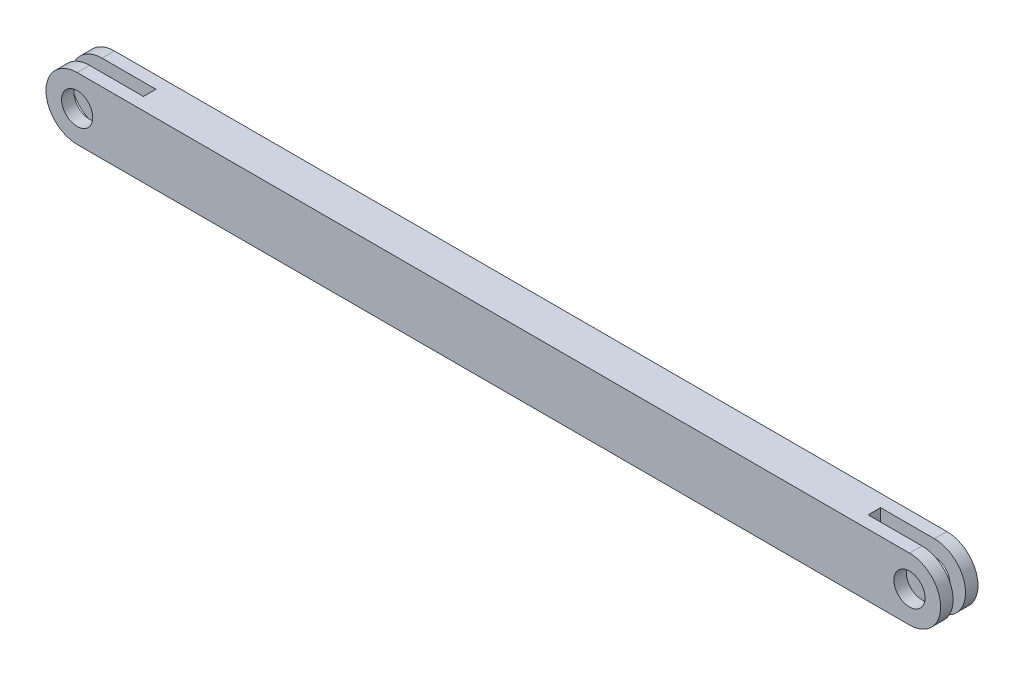
ISO-10303-21;
HEADER;
FILE_DESCRIPTION(('STEP AP214'),'2;1');
FILE_NAME('part.step','',(''),(''),'','','');
FILE_SCHEMA(('AUTOMOTIVE_DESIGN { 1 0 10303 214 1 1 1 1 }'));
ENDSEC;
DATA;
#1=APPLICATION_CONTEXT('core data for automotive mechanical design processes');
#2=APPLICATION_PROTOCOL_DEFINITION('international standard','automotive_design',2000,#1);
#3=PRODUCT_CONTEXT('',#1,'mechanical');
#4=PRODUCT('Part','Part','',(#3));
#5=PRODUCT_RELATED_PRODUCT_CATEGORY('part','',(#4));
#6=PRODUCT_DEFINITION_FORMATION('','',#4);
#7=PRODUCT_DEFINITION_CONTEXT('part definition',#1,'design');
#8=PRODUCT_DEFINITION('design','',#6,#7);
#9=PRODUCT_DEFINITION_SHAPE('','',#8);
#10=(LENGTH_UNIT() NAMED_UNIT(*) SI_UNIT(.MILLI.,.METRE.));
#11=(NAMED_UNIT(*) PLANE_ANGLE_UNIT() SI_UNIT($,.RADIAN.));
#12=(NAMED_UNIT(*) SI_UNIT($,.STERADIAN.) SOLID_ANGLE_UNIT());
#13=UNCERTAINTY_MEASURE_WITH_UNIT(LENGTH_MEASURE(1.E-05),#10,'distance_accuracy_value','');
#14=(GEOMETRIC_REPRESENTATION_CONTEXT(3) GLOBAL_UNCERTAINTY_ASSIGNED_CONTEXT((#13)) GLOBAL_UNIT_ASSIGNED_CONTEXT((#10,
#11,#12)) REPRESENTATION_CONTEXT('',''));
#15=CARTESIAN_POINT('',(0.,0.,0.));
#16=DIRECTION('',(0.,0.,1.));
#17=DIRECTION('',(1.,0.,0.));
#18=AXIS2_PLACEMENT_3D('',#15,#16,#17);
#19=CARTESIAN_POINT('',(-58.1781458426693,-5.35076509103583,3.));
#20=DIRECTION('',(-1.,0.,0.));
#21=DIRECTION('',(0.,0.,1.));
#22=AXIS2_PLACEMENT_3D('',#19,#20,#21);
#23=PLANE('',#22);
#24=DIRECTION('',(0.,0.,-1.));
#25=VECTOR('',#24,1.);
#26=CARTESIAN_POINT('',(-58.1781458426693,4.64923490896418,3.));
#27=LINE('',#26,#25);
#28=CARTESIAN_POINT('',(-58.1781458426693,4.64923490896418,1.));
#29=VERTEX_POINT('',#28);
#30=CARTESIAN_POINT('',(-58.1781458426693,4.64923490896419,-1.));
#31=VERTEX_POINT('',#30);
#32=EDGE_CURVE('E47',#29,#31,#27,.T.);
#33=ORIENTED_EDGE('',*,*,#32,.T.);
#34=DIRECTION('',(0.,-1.,0.));
#35=VECTOR('',#34,1.);
#36=CARTESIAN_POINT('',(-58.1781458426693,-5.35076509103583,-1.));
#37=LINE('',#36,#35);
#38=CARTESIAN_POINT('',(-58.1781458426693,-5.35076509103581,-1.));
#39=VERTEX_POINT('',#38);
#40=EDGE_CURVE('E135',#31,#39,#37,.T.);
#41=ORIENTED_EDGE('',*,*,#40,.T.);
#42=DIRECTION('',(0.,0.,-1.));
#43=VECTOR('',#42,1.);
#44=CARTESIAN_POINT('',(-58.1781458426693,-5.35076509103583,3.));
#45=LINE('',#44,#43);
#46=CARTESIAN_POINT('',(-58.1781458426693,-5.35076509103583,1.));
#47=VERTEX_POINT('',#46);
#48=EDGE_CURVE('E59',#47,#39,#45,.T.);
#49=ORIENTED_EDGE('',*,*,#48,.F.);
#50=DIRECTION('',(0.,1.,0.));
#51=VECTOR('',#50,1.);
#52=CARTESIAN_POINT('',(-58.1781458426693,-5.35076509103583,1.));
#53=LINE('',#52,#51);
#54=EDGE_CURVE('E54',#47,#29,#53,.T.);
#55=ORIENTED_EDGE('',*,*,#54,.T.);
#56=EDGE_LOOP('',(#33,#41,#49,#55));
#57=FACE_BOUND('',#56,.T.);
#58=ADVANCED_FACE('F39',(#57),#23,.T.);
#59=CARTESIAN_POINT('',(0.,0.,1.));
#60=DIRECTION('',(0.,0.,1.));
#61=DIRECTION('',(1.,0.,0.));
#62=AXIS2_PLACEMENT_3D('',#59,#60,#61);
#63=PLANE('',#62);
#64=CARTESIAN_POINT('',(66.8218541573307,-0.350765091035815,1.));
#65=DIRECTION('',(0.,0.,1.));
#66=DIRECTION('',(1.,0.,0.));
#67=AXIS2_PLACEMENT_3D('',#64,#65,#66);
#68=CIRCLE('',#67,2.49999999999999);
#69=CARTESIAN_POINT('',(69.3218541573307,-0.350765091035815,1.));
#70=VERTEX_POINT('',#69);
#71=EDGE_CURVE('E214',#70,#70,#68,.T.);
#72=ORIENTED_EDGE('',*,*,#71,.T.);
#73=EDGE_LOOP('',(#72));
#74=FACE_BOUND('',#73,.T.);
#75=DIRECTION('',(0.,-1.,0.));
#76=VECTOR('',#75,1.);
#77=CARTESIAN_POINT('',(58.1781458426693,0.,1.));
#78=LINE('',#77,#76);
#79=CARTESIAN_POINT('',(58.1781458426693,4.64923490896418,1.));
#80=VERTEX_POINT('',#79);
#81=CARTESIAN_POINT('',(58.1781458426693,-5.35076509103583,1.));
#82=VERTEX_POINT('',#81);
#83=EDGE_CURVE('E190',#80,#82,#78,.T.);
#84=ORIENTED_EDGE('',*,*,#83,.F.);
#85=DIRECTION('',(1.,0.,0.));
#86=VECTOR('',#85,1.);
#87=CARTESIAN_POINT('',(0.,4.64923490896419,1.));
#88=LINE('',#87,#86);
#89=CARTESIAN_POINT('',(66.8218541573307,4.64923490896419,1.));
#90=VERTEX_POINT('',#89);
#91=EDGE_CURVE('E221',#80,#90,#88,.T.);
#92=ORIENTED_EDGE('',*,*,#91,.T.);
#93=CARTESIAN_POINT('',(66.8218541573307,-0.350765091035815,1.));
#94=DIRECTION('',(0.,0.,1.));
#95=DIRECTION('',(1.,0.,0.));
#96=AXIS2_PLACEMENT_3D('',#93,#94,#95);
#97=CIRCLE('',#96,5.);
#98=CARTESIAN_POINT('',(66.8218541573307,-5.35076509103581,1.));
#99=VERTEX_POINT('',#98);
#100=EDGE_CURVE('E217',#90,#99,#97,.F.);
#101=ORIENTED_EDGE('',*,*,#100,.T.);
#102=DIRECTION('',(1.,0.,0.));
#103=VECTOR('',#102,1.);
#104=CARTESIAN_POINT('',(0.,-5.35076509103581,1.));
#105=LINE('',#104,#103);
#106=EDGE_CURVE('E223',#82,#99,#105,.T.);
#107=ORIENTED_EDGE('',*,*,#106,.F.);
#108=EDGE_LOOP('',(#84,#92,#101,#107));
#109=FACE_BOUND('',#108,.T.);
#110=ADVANCED_FACE('F270',(#74,#109),#63,.F.);
#111=CARTESIAN_POINT('',(0.,0.,-1.));
#112=DIRECTION('',(0.,0.,-1.));
#113=DIRECTION('',(1.,0.,0.));
#114=AXIS2_PLACEMENT_3D('',#111,#112,#113);
#115=PLANE('',#114);
#116=CARTESIAN_POINT('',(66.8218541573307,-0.350765091035815,-1.));
#117=DIRECTION('',(0.,0.,1.));
#118=DIRECTION('',(1.,0.,0.));
#119=AXIS2_PLACEMENT_3D('',#116,#117,#118);
#120=CIRCLE('',#119,2.49999999999999);
#121=CARTESIAN_POINT('',(69.3218541573307,-0.350765091035815,-1.));
#122=VERTEX_POINT('',#121);
#123=EDGE_CURVE('E193',#122,#122,#120,.T.);
#124=ORIENTED_EDGE('',*,*,#123,.F.);
#125=EDGE_LOOP('',(#124));
#126=FACE_BOUND('',#125,.T.);
#127=DIRECTION('',(0.,1.,0.));
#128=VECTOR('',#127,1.);
#129=CARTESIAN_POINT('',(58.1781458426693,0.,-1.));
#130=LINE('',#129,#128);
#131=CARTESIAN_POINT('',(58.1781458426693,-5.35076509103583,-1.));
#132=VERTEX_POINT('',#131);
#133=CARTESIAN_POINT('',(58.1781458426693,4.64923490896419,-1.));
#134=VERTEX_POINT('',#133);
#135=EDGE_CURVE('E11',#132,#134,#130,.T.);
#136=ORIENTED_EDGE('',*,*,#135,.F.);
#137=DIRECTION('',(1.,0.,0.));
#138=VECTOR('',#137,1.);
#139=CARTESIAN_POINT('',(0.,-5.35076509103581,-1.));
#140=LINE('',#139,#138);
#141=CARTESIAN_POINT('',(66.8218541573307,-5.35076509103581,-1.));
#142=VERTEX_POINT('',#141);
#143=EDGE_CURVE('E200',#132,#142,#140,.T.);
#144=ORIENTED_EDGE('',*,*,#143,.T.);
#145=CARTESIAN_POINT('',(66.8218541573307,-0.350765091035815,-1.));
#146=DIRECTION('',(0.,0.,1.));
#147=DIRECTION('',(1.,0.,0.));
#148=AXIS2_PLACEMENT_3D('',#145,#146,#147);
#149=CIRCLE('',#148,5.);
#150=CARTESIAN_POINT('',(66.8218541573307,4.64923490896419,-1.));
#151=VERTEX_POINT('',#150);
#152=EDGE_CURVE('E196',#151,#142,#149,.F.);
#153=ORIENTED_EDGE('',*,*,#152,.F.);
#154=DIRECTION('',(1.,0.,0.));
#155=VECTOR('',#154,1.);
#156=CARTESIAN_POINT('',(0.,4.64923490896419,-1.));
#157=LINE('',#156,#155);
#158=EDGE_CURVE('E202',#134,#151,#157,.T.);
#159=ORIENTED_EDGE('',*,*,#158,.F.);
#160=EDGE_LOOP('',(#136,#144,#153,#159));
#161=FACE_BOUND('',#160,.T.);
#162=ADVANCED_FACE('F278',(#126,#161),#115,.F.);
#163=CARTESIAN_POINT('',(56.8218541573307,4.64923490896419,3.));
#164=DIRECTION('',(0.,-1.,0.));
#165=DIRECTION('',(1.,0.,0.));
#166=AXIS2_PLACEMENT_3D('',#163,#164,#165);
#167=PLANE('',#166);
#168=DIRECTION('',(-1.,0.,0.));
#169=VECTOR('',#168,1.);
#170=CARTESIAN_POINT('',(56.8218541573307,4.64923490896419,-3.));
#171=LINE('',#170,#169);
#172=CARTESIAN_POINT('',(66.8218541573307,4.64923490896419,-3.));
#173=VERTEX_POINT('',#172);
#174=CARTESIAN_POINT('',(-66.8218541573307,4.64923490896419,-3.));
#175=VERTEX_POINT('',#174);
#176=EDGE_CURVE('E142',#173,#175,#171,.T.);
#177=ORIENTED_EDGE('',*,*,#176,.T.);
#178=DIRECTION('',(0.,0.,-1.));
#179=VECTOR('',#178,1.);
#180=CARTESIAN_POINT('',(-66.8218541573307,4.64923490896419,-1.));
#181=LINE('',#180,#179);
#182=CARTESIAN_POINT('',(-66.8218541573307,4.64923490896419,-1.));
#183=VERTEX_POINT('',#182);
#184=EDGE_CURVE('E140',#183,#175,#181,.T.);
#185=ORIENTED_EDGE('',*,*,#184,.F.);
#186=DIRECTION('',(-1.,0.,0.));
#187=VECTOR('',#186,1.);
#188=CARTESIAN_POINT('',(0.,4.64923490896419,-1.));
#189=LINE('',#188,#187);
#190=EDGE_CURVE('E128',#31,#183,#189,.T.);
#191=ORIENTED_EDGE('',*,*,#190,.F.);
#192=ORIENTED_EDGE('',*,*,#32,.F.);
#193=DIRECTION('',(-1.,0.,0.));
#194=VECTOR('',#193,1.);
#195=CARTESIAN_POINT('',(0.,4.64923490896419,1.));
#196=LINE('',#195,#194);
#197=CARTESIAN_POINT('',(-66.8218541573307,4.64923490896419,1.));
#198=VERTEX_POINT('',#197);
#199=EDGE_CURVE('E173',#29,#198,#196,.T.);
#200=ORIENTED_EDGE('',*,*,#199,.T.);
#201=DIRECTION('',(0.,0.,1.));
#202=VECTOR('',#201,1.);
#203=CARTESIAN_POINT('',(-66.8218541573307,4.64923490896419,1.));
#204=LINE('',#203,#202);
#205=CARTESIAN_POINT('',(-66.8218541573307,4.64923490896419,3.));
#206=VERTEX_POINT('',#205);
#207=EDGE_CURVE('E180',#198,#206,#204,.T.);
#208=ORIENTED_EDGE('',*,*,#207,.T.);
#209=DIRECTION('',(-1.,0.,0.));
#210=VECTOR('',#209,1.);
#211=CARTESIAN_POINT('',(56.8218541573307,4.64923490896419,3.));
#212=LINE('',#211,#210);
#213=CARTESIAN_POINT('',(66.8218541573307,4.64923490896419,3.));
#214=VERTEX_POINT('',#213);
#215=EDGE_CURVE('E235',#214,#206,#212,.T.);
#216=ORIENTED_EDGE('',*,*,#215,.F.);
#217=DIRECTION('',(0.,0.,1.));
#218=VECTOR('',#217,1.);
#219=CARTESIAN_POINT('',(66.8218541573307,4.64923490896419,1.));
#220=LINE('',#219,#218);
#221=EDGE_CURVE('E225',#90,#214,#220,.T.);
#222=ORIENTED_EDGE('',*,*,#221,.F.);
#223=ORIENTED_EDGE('',*,*,#91,.F.);
#224=DIRECTION('',(0.,0.,-1.));
#225=VECTOR('',#224,1.);
#226=CARTESIAN_POINT('',(58.1781458426693,4.64923490896418,3.));
#227=LINE('',#226,#225);
#228=EDGE_CURVE('E186',#80,#134,#227,.T.);
#229=ORIENTED_EDGE('',*,*,#228,.T.);
#230=ORIENTED_EDGE('',*,*,#158,.T.);
#231=DIRECTION('',(0.,0.,-1.));
#232=VECTOR('',#231,1.);
#233=CARTESIAN_POINT('',(66.8218541573307,4.64923490896419,-1.));
#234=LINE('',#233,#232);
#235=EDGE_CURVE('E209',#151,#173,#234,.T.);
#236=ORIENTED_EDGE('',*,*,#235,.T.);
#237=EDGE_LOOP('',(#177,#185,#191,#192,#200,#208,#216,#222,#223,#229,#230,#236));
#238=FACE_BOUND('',#237,.T.);
#239=ADVANCED_FACE('F41',(#238),#167,.F.);
#240=CARTESIAN_POINT('',(56.8218541573307,-5.35076509103581,3.));
#241=DIRECTION('',(0.,-1.,0.));
#242=DIRECTION('',(1.,0.,0.));
#243=AXIS2_PLACEMENT_3D('',#240,#241,#242);
#244=PLANE('',#243);
#245=DIRECTION('',(0.,0.,-1.));
#246=VECTOR('',#245,1.);
#247=CARTESIAN_POINT('',(-66.8218541573307,-5.35076509103581,-1.));
#248=LINE('',#247,#246);
#249=CARTESIAN_POINT('',(-66.8218541573307,-5.35076509103581,-1.));
#250=VERTEX_POINT('',#249);
#251=CARTESIAN_POINT('',(-66.8218541573307,-5.35076509103581,-3.));
#252=VERTEX_POINT('',#251);
#253=EDGE_CURVE('E146',#250,#252,#248,.T.);
#254=ORIENTED_EDGE('',*,*,#253,.T.);
#255=DIRECTION('',(-1.,0.,0.));
#256=VECTOR('',#255,1.);
#257=CARTESIAN_POINT('',(56.8218541573307,-5.35076509103581,-3.));
#258=LINE('',#257,#256);
#259=CARTESIAN_POINT('',(66.8218541573307,-5.35076509103581,-3.));
#260=VERTEX_POINT('',#259);
#261=EDGE_CURVE('E238',#260,#252,#258,.T.);
#262=ORIENTED_EDGE('',*,*,#261,.F.);
#263=DIRECTION('',(0.,0.,-1.));
#264=VECTOR('',#263,1.);
#265=CARTESIAN_POINT('',(66.8218541573307,-5.35076509103581,-1.));
#266=LINE('',#265,#264);
#267=EDGE_CURVE('E204',#142,#260,#266,.T.);
#268=ORIENTED_EDGE('',*,*,#267,.F.);
#269=ORIENTED_EDGE('',*,*,#143,.F.);
#270=DIRECTION('',(0.,0.,-1.));
#271=VECTOR('',#270,1.);
#272=CARTESIAN_POINT('',(58.1781458426693,-5.35076509103583,3.));
#273=LINE('',#272,#271);
#274=EDGE_CURVE('E188',#82,#132,#273,.T.);
#275=ORIENTED_EDGE('',*,*,#274,.F.);
#276=ORIENTED_EDGE('',*,*,#106,.T.);
#277=DIRECTION('',(0.,0.,1.));
#278=VECTOR('',#277,1.);
#279=CARTESIAN_POINT('',(66.8218541573307,-5.35076509103581,1.));
#280=LINE('',#279,#278);
#281=CARTESIAN_POINT('',(66.8218541573307,-5.35076509103581,3.));
#282=VERTEX_POINT('',#281);
#283=EDGE_CURVE('E230',#99,#282,#280,.T.);
#284=ORIENTED_EDGE('',*,*,#283,.T.);
#285=DIRECTION('',(-1.,0.,0.));
#286=VECTOR('',#285,1.);
#287=CARTESIAN_POINT('',(56.8218541573307,-5.35076509103581,3.));
#288=LINE('',#287,#286);
#289=CARTESIAN_POINT('',(-66.8218541573307,-5.35076509103581,3.));
#290=VERTEX_POINT('',#289);
#291=EDGE_CURVE('E237',#282,#290,#288,.T.);
#292=ORIENTED_EDGE('',*,*,#291,.T.);
#293=DIRECTION('',(0.,0.,1.));
#294=VECTOR('',#293,1.);
#295=CARTESIAN_POINT('',(-66.8218541573307,-5.35076509103581,1.));
#296=LINE('',#295,#294);
#297=CARTESIAN_POINT('',(-66.8218541573307,-5.35076509103581,1.));
#298=VERTEX_POINT('',#297);
#299=EDGE_CURVE('E175',#298,#290,#296,.T.);
#300=ORIENTED_EDGE('',*,*,#299,.F.);
#301=DIRECTION('',(-1.,0.,0.));
#302=VECTOR('',#301,1.);
#303=CARTESIAN_POINT('',(0.,-5.35076509103581,1.));
#304=LINE('',#303,#302);
#305=EDGE_CURVE('E171',#47,#298,#304,.T.);
#306=ORIENTED_EDGE('',*,*,#305,.F.);
#307=ORIENTED_EDGE('',*,*,#48,.T.);
#308=DIRECTION('',(-1.,0.,0.));
#309=VECTOR('',#308,1.);
#310=CARTESIAN_POINT('',(0.,-5.35076509103581,-1.));
#311=LINE('',#310,#309);
#312=EDGE_CURVE('E137',#39,#250,#311,.T.);
#313=ORIENTED_EDGE('',*,*,#312,.T.);
#314=EDGE_LOOP('',(#254,#262,#268,#269,#275,#276,#284,#292,#300,#306,#307,#313));
#315=FACE_BOUND('',#314,.T.);
#316=ADVANCED_FACE('F264',(#315),#244,.T.);
#317=CARTESIAN_POINT('',(0.,0.,3.));
#318=DIRECTION('',(0.,0.,1.));
#319=DIRECTION('',(1.,0.,0.));
#320=AXIS2_PLACEMENT_3D('',#317,#318,#319);
#321=PLANE('',#320);
#322=ORIENTED_EDGE('',*,*,#215,.T.);
#323=CARTESIAN_POINT('',(-66.8218541573307,-0.350765091035815,3.));
#324=DIRECTION('',(0.,0.,-1.));
#325=DIRECTION('',(-1.,0.,0.));
#326=AXIS2_PLACEMENT_3D('',#323,#324,#325);
#327=CIRCLE('',#326,5.);
#328=EDGE_CURVE('E168',#206,#290,#327,.F.);
#329=ORIENTED_EDGE('',*,*,#328,.T.);
#330=ORIENTED_EDGE('',*,*,#291,.F.);
#331=CARTESIAN_POINT('',(66.8218541573307,-0.350765091035815,3.));
#332=DIRECTION('',(0.,0.,1.));
#333=DIRECTION('',(1.,0.,0.));
#334=AXIS2_PLACEMENT_3D('',#331,#332,#333);
#335=CIRCLE('',#334,5.);
#336=EDGE_CURVE('E218',#214,#282,#335,.F.);
#337=ORIENTED_EDGE('',*,*,#336,.F.);
#338=EDGE_LOOP('',(#322,#329,#330,#337));
#339=FACE_BOUND('',#338,.T.);
#340=CARTESIAN_POINT('',(66.8218541573307,-0.350765091035815,3.));
#341=DIRECTION('',(0.,0.,1.));
#342=DIRECTION('',(1.,0.,0.));
#343=AXIS2_PLACEMENT_3D('',#340,#341,#342);
#344=CIRCLE('',#343,2.49999999999999);
#345=CARTESIAN_POINT('',(69.3218541573307,-0.350765091035815,3.));
#346=VERTEX_POINT('',#345);
#347=EDGE_CURVE('E211',#346,#346,#344,.T.);
#348=ORIENTED_EDGE('',*,*,#347,.F.);
#349=EDGE_LOOP('',(#348));
#350=FACE_BOUND('',#349,.T.);
#351=CARTESIAN_POINT('',(-66.8218541573307,-0.350765091035815,3.));
#352=DIRECTION('',(0.,0.,-1.));
#353=DIRECTION('',(-1.,0.,0.));
#354=AXIS2_PLACEMENT_3D('',#351,#352,#353);
#355=CIRCLE('',#354,2.49999999999999);
#356=CARTESIAN_POINT('',(-69.3218541573307,-0.350765091035815,3.));
#357=VERTEX_POINT('',#356);
#358=EDGE_CURVE('E163',#357,#357,#355,.T.);
#359=ORIENTED_EDGE('',*,*,#358,.T.);
#360=EDGE_LOOP('',(#359));
#361=FACE_BOUND('',#360,.T.);
#362=ADVANCED_FACE('F261',(#339,#350,#361),#321,.T.);
#363=CARTESIAN_POINT('',(0.,0.,-3.));
#364=DIRECTION('',(0.,0.,1.));
#365=DIRECTION('',(1.,0.,0.));
#366=AXIS2_PLACEMENT_3D('',#363,#364,#365);
#367=PLANE('',#366);
#368=CARTESIAN_POINT('',(-66.8218541573307,-0.350765091035815,-3.));
#369=DIRECTION('',(0.,0.,-1.));
#370=DIRECTION('',(-1.,0.,0.));
#371=AXIS2_PLACEMENT_3D('',#368,#369,#370);
#372=CIRCLE('',#371,5.);
#373=EDGE_CURVE('E153',#175,#252,#372,.F.);
#374=ORIENTED_EDGE('',*,*,#373,.F.);
#375=ORIENTED_EDGE('',*,*,#176,.F.);
#376=CARTESIAN_POINT('',(66.8218541573307,-0.350765091035815,-3.));
#377=DIRECTION('',(0.,0.,1.));
#378=DIRECTION('',(1.,0.,0.));
#379=AXIS2_PLACEMENT_3D('',#376,#377,#378);
#380=CIRCLE('',#379,5.);
#381=EDGE_CURVE('E197',#173,#260,#380,.F.);
#382=ORIENTED_EDGE('',*,*,#381,.T.);
#383=ORIENTED_EDGE('',*,*,#261,.T.);
#384=EDGE_LOOP('',(#374,#375,#382,#383));
#385=FACE_BOUND('',#384,.T.);
#386=CARTESIAN_POINT('',(66.8218541573307,-0.350765091035815,-3.));
#387=DIRECTION('',(0.,0.,1.));
#388=DIRECTION('',(1.,0.,0.));
#389=AXIS2_PLACEMENT_3D('',#386,#387,#388);
#390=CIRCLE('',#389,2.49999999999999);
#391=CARTESIAN_POINT('',(69.3218541573307,-0.350765091035815,-3.));
#392=VERTEX_POINT('',#391);
#393=EDGE_CURVE('E192',#392,#392,#390,.T.);
#394=ORIENTED_EDGE('',*,*,#393,.T.);
#395=EDGE_LOOP('',(#394));
#396=FACE_BOUND('',#395,.T.);
#397=CARTESIAN_POINT('',(-66.8218541573307,-0.350765091035815,-3.));
#398=DIRECTION('',(0.,0.,-1.));
#399=DIRECTION('',(-1.,0.,0.));
#400=AXIS2_PLACEMENT_3D('',#397,#398,#399);
#401=CIRCLE('',#400,2.49999999999999);
#402=CARTESIAN_POINT('',(-69.3218541573307,-0.350765091035815,-3.));
#403=VERTEX_POINT('',#402);
#404=EDGE_CURVE('E157',#403,#403,#401,.T.);
#405=ORIENTED_EDGE('',*,*,#404,.F.);
#406=EDGE_LOOP('',(#405));
#407=FACE_BOUND('',#406,.T.);
#408=ADVANCED_FACE('F284',(#385,#396,#407),#367,.F.);
#409=CARTESIAN_POINT('',(66.8218541573307,-0.350765091035815,1.));
#410=DIRECTION('',(0.,0.,1.));
#411=DIRECTION('',(1.,0.,0.));
#412=AXIS2_PLACEMENT_3D('',#409,#410,#411);
#413=CYLINDRICAL_SURFACE('',#412,5.);
#414=ORIENTED_EDGE('',*,*,#336,.T.);
#415=ORIENTED_EDGE('',*,*,#283,.F.);
#416=ORIENTED_EDGE('',*,*,#100,.F.);
#417=ORIENTED_EDGE('',*,*,#221,.T.);
#418=EDGE_LOOP('',(#414,#415,#416,#417));
#419=FACE_BOUND('',#418,.T.);
#420=ADVANCED_FACE('F259',(#419),#413,.T.);
#421=CARTESIAN_POINT('',(66.8218541573307,-0.350765091035815,1.));
#422=DIRECTION('',(0.,0.,1.));
#423=DIRECTION('',(1.,0.,0.));
#424=AXIS2_PLACEMENT_3D('',#421,#422,#423);
#425=CYLINDRICAL_SURFACE('',#424,2.49999999999999);
#426=ORIENTED_EDGE('',*,*,#71,.F.);
#427=EDGE_LOOP('',(#426));
#428=FACE_BOUND('',#427,.T.);
#429=ORIENTED_EDGE('',*,*,#347,.T.);
#430=EDGE_LOOP('',(#429));
#431=FACE_BOUND('',#430,.T.);
#432=ADVANCED_FACE('F315',(#428,#431),#425,.F.);
#433=CARTESIAN_POINT('',(66.8218541573307,-0.350765091035815,-1.));
#434=DIRECTION('',(0.,0.,-1.));
#435=DIRECTION('',(-1.,0.,0.));
#436=AXIS2_PLACEMENT_3D('',#433,#434,#435);
#437=CYLINDRICAL_SURFACE('',#436,5.);
#438=ORIENTED_EDGE('',*,*,#381,.F.);
#439=ORIENTED_EDGE('',*,*,#235,.F.);
#440=ORIENTED_EDGE('',*,*,#152,.T.);
#441=ORIENTED_EDGE('',*,*,#267,.T.);
#442=EDGE_LOOP('',(#438,#439,#440,#441));
#443=FACE_BOUND('',#442,.T.);
#444=ADVANCED_FACE('F282',(#443),#437,.T.);
#445=CARTESIAN_POINT('',(66.8218541573307,-0.350765091035815,-1.));
#446=DIRECTION('',(0.,0.,-1.));
#447=DIRECTION('',(-1.,0.,0.));
#448=AXIS2_PLACEMENT_3D('',#445,#446,#447);
#449=CYLINDRICAL_SURFACE('',#448,2.49999999999999);
#450=ORIENTED_EDGE('',*,*,#123,.T.);
#451=EDGE_LOOP('',(#450));
#452=FACE_BOUND('',#451,.T.);
#453=ORIENTED_EDGE('',*,*,#393,.F.);
#454=EDGE_LOOP('',(#453));
#455=FACE_BOUND('',#454,.T.);
#456=ADVANCED_FACE('F321',(#452,#455),#449,.F.);
#457=CARTESIAN_POINT('',(58.1781458426693,-5.35076509103583,3.));
#458=DIRECTION('',(-1.,0.,0.));
#459=DIRECTION('',(0.,0.,1.));
#460=AXIS2_PLACEMENT_3D('',#457,#458,#459);
#461=PLANE('',#460);
#462=ORIENTED_EDGE('',*,*,#228,.F.);
#463=ORIENTED_EDGE('',*,*,#83,.T.);
#464=ORIENTED_EDGE('',*,*,#274,.T.);
#465=ORIENTED_EDGE('',*,*,#135,.T.);
#466=EDGE_LOOP('',(#462,#463,#464,#465));
#467=FACE_BOUND('',#466,.T.);
#468=ADVANCED_FACE('F275',(#467),#461,.F.);
#469=CARTESIAN_POINT('',(-66.8218541573307,-0.350765091035815,1.));
#470=DIRECTION('',(0.,0.,1.));
#471=DIRECTION('',(1.,0.,0.));
#472=AXIS2_PLACEMENT_3D('',#469,#470,#471);
#473=CYLINDRICAL_SURFACE('',#472,5.);
#474=ORIENTED_EDGE('',*,*,#328,.F.);
#475=ORIENTED_EDGE('',*,*,#207,.F.);
#476=CARTESIAN_POINT('',(-66.8218541573307,-0.350765091035815,1.));
#477=DIRECTION('',(0.,0.,-1.));
#478=DIRECTION('',(-1.,0.,0.));
#479=AXIS2_PLACEMENT_3D('',#476,#477,#478);
#480=CIRCLE('',#479,5.);
#481=EDGE_CURVE('E167',#198,#298,#480,.F.);
#482=ORIENTED_EDGE('',*,*,#481,.T.);
#483=ORIENTED_EDGE('',*,*,#299,.T.);
#484=EDGE_LOOP('',(#474,#475,#482,#483));
#485=FACE_BOUND('',#484,.T.);
#486=ADVANCED_FACE('F252',(#485),#473,.T.);
#487=CARTESIAN_POINT('',(-66.8218541573307,-0.350765091035815,1.));
#488=DIRECTION('',(0.,0.,1.));
#489=DIRECTION('',(1.,0.,0.));
#490=AXIS2_PLACEMENT_3D('',#487,#488,#489);
#491=CYLINDRICAL_SURFACE('',#490,2.49999999999999);
#492=CARTESIAN_POINT('',(-66.8218541573307,-0.350765091035815,1.));
#493=DIRECTION('',(0.,0.,-1.));
#494=DIRECTION('',(-1.,0.,0.));
#495=AXIS2_PLACEMENT_3D('',#492,#493,#494);
#496=CIRCLE('',#495,2.49999999999999);
#497=CARTESIAN_POINT('',(-69.3218541573307,-0.350765091035815,1.));
#498=VERTEX_POINT('',#497);
#499=EDGE_CURVE('E164',#498,#498,#496,.T.);
#500=ORIENTED_EDGE('',*,*,#499,.T.);
#501=EDGE_LOOP('',(#500));
#502=FACE_BOUND('',#501,.T.);
#503=ORIENTED_EDGE('',*,*,#358,.F.);
#504=EDGE_LOOP('',(#503));
#505=FACE_BOUND('',#504,.T.);
#506=ADVANCED_FACE('F332',(#502,#505),#491,.F.);
#507=CARTESIAN_POINT('',(0.,0.,1.));
#508=DIRECTION('',(0.,0.,1.));
#509=DIRECTION('',(-1.,0.,0.));
#510=AXIS2_PLACEMENT_3D('',#507,#508,#509);
#511=PLANE('',#510);
#512=ORIENTED_EDGE('',*,*,#54,.F.);
#513=ORIENTED_EDGE('',*,*,#305,.T.);
#514=ORIENTED_EDGE('',*,*,#481,.F.);
#515=ORIENTED_EDGE('',*,*,#199,.F.);
#516=EDGE_LOOP('',(#512,#513,#514,#515));
#517=FACE_BOUND('',#516,.T.);
#518=ORIENTED_EDGE('',*,*,#499,.F.);
#519=EDGE_LOOP('',(#518));
#520=FACE_BOUND('',#519,.T.);
#521=ADVANCED_FACE('F246',(#517,#520),#511,.F.);
#522=CARTESIAN_POINT('',(-66.8218541573307,-0.350765091035815,-1.));
#523=DIRECTION('',(0.,0.,-1.));
#524=DIRECTION('',(-1.,0.,0.));
#525=AXIS2_PLACEMENT_3D('',#522,#523,#524);
#526=CYLINDRICAL_SURFACE('',#525,5.);
#527=ORIENTED_EDGE('',*,*,#373,.T.);
#528=ORIENTED_EDGE('',*,*,#253,.F.);
#529=CARTESIAN_POINT('',(-66.8218541573307,-0.350765091035815,-1.));
#530=DIRECTION('',(0.,0.,-1.));
#531=DIRECTION('',(-1.,0.,0.));
#532=AXIS2_PLACEMENT_3D('',#529,#530,#531);
#533=CIRCLE('',#532,5.);
#534=EDGE_CURVE('E133',#183,#250,#533,.F.);
#535=ORIENTED_EDGE('',*,*,#534,.F.);
#536=ORIENTED_EDGE('',*,*,#184,.T.);
#537=EDGE_LOOP('',(#527,#528,#535,#536));
#538=FACE_BOUND('',#537,.T.);
#539=ADVANCED_FACE('F148',(#538),#526,.T.);
#540=CARTESIAN_POINT('',(-66.8218541573307,-0.350765091035815,-1.));
#541=DIRECTION('',(0.,0.,-1.));
#542=DIRECTION('',(-1.,0.,0.));
#543=AXIS2_PLACEMENT_3D('',#540,#541,#542);
#544=CYLINDRICAL_SURFACE('',#543,2.49999999999999);
#545=CARTESIAN_POINT('',(-66.8218541573307,-0.350765091035815,-1.));
#546=DIRECTION('',(0.,0.,-1.));
#547=DIRECTION('',(-1.,0.,0.));
#548=AXIS2_PLACEMENT_3D('',#545,#546,#547);
#549=CIRCLE('',#548,2.49999999999999);
#550=CARTESIAN_POINT('',(-69.3218541573307,-0.350765091035815,-1.));
#551=VERTEX_POINT('',#550);
#552=EDGE_CURVE('E150',#551,#551,#549,.T.);
#553=ORIENTED_EDGE('',*,*,#552,.F.);
#554=EDGE_LOOP('',(#553));
#555=FACE_BOUND('',#554,.T.);
#556=ORIENTED_EDGE('',*,*,#404,.T.);
#557=EDGE_LOOP('',(#556));
#558=FACE_BOUND('',#557,.T.);
#559=ADVANCED_FACE('F292',(#555,#558),#544,.F.);
#560=CARTESIAN_POINT('',(0.,0.,-1.));
#561=DIRECTION('',(0.,0.,-1.));
#562=DIRECTION('',(-1.,0.,0.));
#563=AXIS2_PLACEMENT_3D('',#560,#561,#562);
#564=PLANE('',#563);
#565=ORIENTED_EDGE('',*,*,#40,.F.);
#566=ORIENTED_EDGE('',*,*,#190,.T.);
#567=ORIENTED_EDGE('',*,*,#534,.T.);
#568=ORIENTED_EDGE('',*,*,#312,.F.);
#569=EDGE_LOOP('',(#565,#566,#567,#568));
#570=FACE_BOUND('',#569,.T.);
#571=ORIENTED_EDGE('',*,*,#552,.T.);
#572=EDGE_LOOP('',(#571));
#573=FACE_BOUND('',#572,.T.);
#574=ADVANCED_FACE('F130',(#570,#573),#564,.F.);
#575=CLOSED_SHELL('',(#58,#110,#162,#239,#316,#362,#408,#420,#432,#444,#456,#468,#486,#506,#521,
#539,#559,#574));
#576=MANIFOLD_SOLID_BREP('B2',#575);
#577=ADVANCED_BREP_SHAPE_REPRESENTATION('',(#18,#576),#14);
#578=SHAPE_DEFINITION_REPRESENTATION(#9,#577);
ENDSEC;
END-ISO-10303-21;
